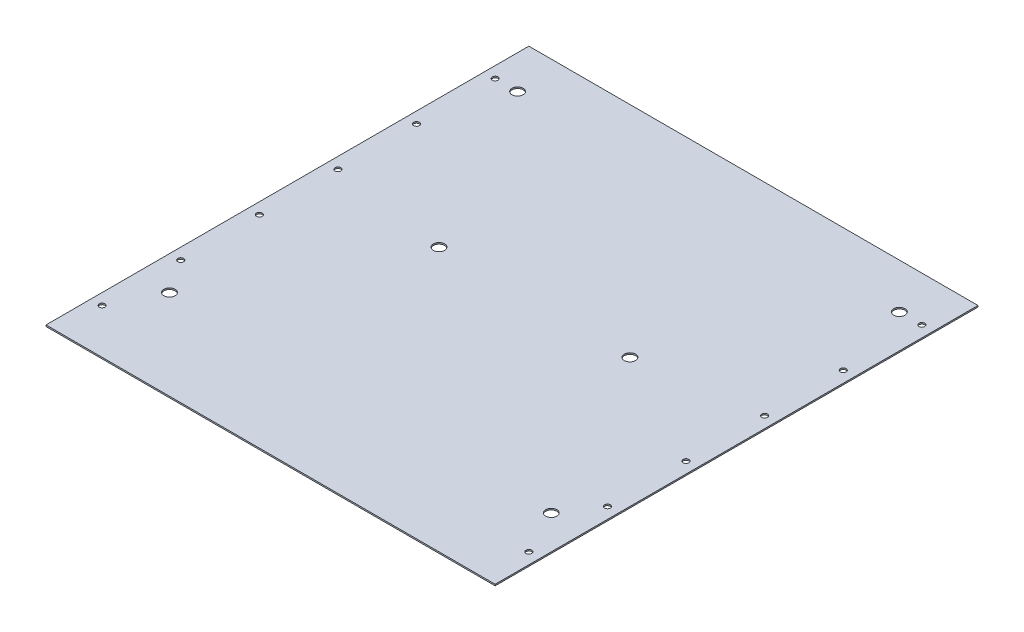
ISO-10303-21;
HEADER;
FILE_DESCRIPTION(('STEP AP214'),'2;1');
FILE_NAME('part.step','',(''),(''),'','','');
FILE_SCHEMA(('AUTOMOTIVE_DESIGN { 1 0 10303 214 1 1 1 1 }'));
ENDSEC;
DATA;
#1=APPLICATION_CONTEXT('core data for automotive mechanical design processes');
#2=APPLICATION_PROTOCOL_DEFINITION('international standard','automotive_design',2000,#1);
#3=PRODUCT_CONTEXT('',#1,'mechanical');
#4=PRODUCT('Part','Part','',(#3));
#5=PRODUCT_RELATED_PRODUCT_CATEGORY('part','',(#4));
#6=PRODUCT_DEFINITION_FORMATION('','',#4);
#7=PRODUCT_DEFINITION_CONTEXT('part definition',#1,'design');
#8=PRODUCT_DEFINITION('design','',#6,#7);
#9=PRODUCT_DEFINITION_SHAPE('','',#8);
#10=(LENGTH_UNIT() NAMED_UNIT(*) SI_UNIT(.MILLI.,.METRE.));
#11=(NAMED_UNIT(*) PLANE_ANGLE_UNIT() SI_UNIT($,.RADIAN.));
#12=(NAMED_UNIT(*) SI_UNIT($,.STERADIAN.) SOLID_ANGLE_UNIT());
#13=UNCERTAINTY_MEASURE_WITH_UNIT(LENGTH_MEASURE(1.E-05),#10,'distance_accuracy_value','');
#14=(GEOMETRIC_REPRESENTATION_CONTEXT(3) GLOBAL_UNCERTAINTY_ASSIGNED_CONTEXT((#13)) GLOBAL_UNIT_ASSIGNED_CONTEXT((#10,
#11,#12)) REPRESENTATION_CONTEXT('',''));
#15=CARTESIAN_POINT('',(0.,0.,0.));
#16=DIRECTION('',(0.,0.,1.));
#17=DIRECTION('',(1.,0.,0.));
#18=AXIS2_PLACEMENT_3D('',#15,#16,#17);
#19=CARTESIAN_POINT('',(-254.,1.6002,273.05));
#20=DIRECTION('',(1.,0.,0.));
#21=DIRECTION('',(0.,0.,1.));
#22=AXIS2_PLACEMENT_3D('',#19,#20,#21);
#23=PLANE('',#22);
#24=DIRECTION('',(0.,1.,0.));
#25=VECTOR('',#24,1.);
#26=CARTESIAN_POINT('',(-254.,1.6002,-273.05));
#27=LINE('',#26,#25);
#28=CARTESIAN_POINT('',(-254.,0.,-273.05));
#29=VERTEX_POINT('',#28);
#30=CARTESIAN_POINT('',(-254.,1.6002,-273.05));
#31=VERTEX_POINT('',#30);
#32=EDGE_CURVE('E11',#29,#31,#27,.T.);
#33=ORIENTED_EDGE('',*,*,#32,.F.);
#34=DIRECTION('',(0.,0.,-1.));
#35=VECTOR('',#34,1.);
#36=CARTESIAN_POINT('',(-254.,0.,0.));
#37=LINE('',#36,#35);
#38=CARTESIAN_POINT('',(-254.,0.,273.05));
#39=VERTEX_POINT('',#38);
#40=EDGE_CURVE('E97',#29,#39,#37,.F.);
#41=ORIENTED_EDGE('',*,*,#40,.T.);
#42=DIRECTION('',(0.,1.,0.));
#43=VECTOR('',#42,1.);
#44=CARTESIAN_POINT('',(-254.,1.6002,273.05));
#45=LINE('',#44,#43);
#46=CARTESIAN_POINT('',(-254.,1.6002,273.05));
#47=VERTEX_POINT('',#46);
#48=EDGE_CURVE('E50',#39,#47,#45,.T.);
#49=ORIENTED_EDGE('',*,*,#48,.T.);
#50=DIRECTION('',(0.,0.,1.));
#51=VECTOR('',#50,1.);
#52=CARTESIAN_POINT('',(-254.,1.6002,273.05));
#53=LINE('',#52,#51);
#54=EDGE_CURVE('E220',#31,#47,#53,.T.);
#55=ORIENTED_EDGE('',*,*,#54,.F.);
#56=EDGE_LOOP('',(#33,#41,#49,#55));
#57=FACE_BOUND('',#56,.T.);
#58=ADVANCED_FACE('F40',(#57),#23,.F.);
#59=CARTESIAN_POINT('',(-254.,1.6002,273.05));
#60=DIRECTION('',(0.,0.,-1.));
#61=DIRECTION('',(1.,0.,0.));
#62=AXIS2_PLACEMENT_3D('',#59,#60,#61);
#63=PLANE('',#62);
#64=ORIENTED_EDGE('',*,*,#48,.F.);
#65=DIRECTION('',(1.,0.,0.));
#66=VECTOR('',#65,1.);
#67=CARTESIAN_POINT('',(0.,0.,273.05));
#68=LINE('',#67,#66);
#69=CARTESIAN_POINT('',(254.,0.,273.05));
#70=VERTEX_POINT('',#69);
#71=EDGE_CURVE('E108',#39,#70,#68,.T.);
#72=ORIENTED_EDGE('',*,*,#71,.T.);
#73=DIRECTION('',(0.,1.,0.));
#74=VECTOR('',#73,1.);
#75=CARTESIAN_POINT('',(254.,1.6002,273.05));
#76=LINE('',#75,#74);
#77=CARTESIAN_POINT('',(254.,1.6002,273.05));
#78=VERTEX_POINT('',#77);
#79=EDGE_CURVE('E59',#70,#78,#76,.T.);
#80=ORIENTED_EDGE('',*,*,#79,.T.);
#81=DIRECTION('',(1.,0.,0.));
#82=VECTOR('',#81,1.);
#83=CARTESIAN_POINT('',(-254.,1.6002,273.05));
#84=LINE('',#83,#82);
#85=EDGE_CURVE('E90',#47,#78,#84,.T.);
#86=ORIENTED_EDGE('',*,*,#85,.F.);
#87=EDGE_LOOP('',(#64,#72,#80,#86));
#88=FACE_BOUND('',#87,.T.);
#89=ADVANCED_FACE('F225',(#88),#63,.F.);
#90=CARTESIAN_POINT('',(254.,1.6002,273.05));
#91=DIRECTION('',(-1.,0.,0.));
#92=DIRECTION('',(0.,0.,-1.));
#93=AXIS2_PLACEMENT_3D('',#90,#91,#92);
#94=PLANE('',#93);
#95=ORIENTED_EDGE('',*,*,#79,.F.);
#96=DIRECTION('',(0.,0.,-1.));
#97=VECTOR('',#96,1.);
#98=CARTESIAN_POINT('',(254.,0.,0.));
#99=LINE('',#98,#97);
#100=CARTESIAN_POINT('',(254.,0.,-273.05));
#101=VERTEX_POINT('',#100);
#102=EDGE_CURVE('E96',#70,#101,#99,.T.);
#103=ORIENTED_EDGE('',*,*,#102,.T.);
#104=DIRECTION('',(0.,1.,0.));
#105=VECTOR('',#104,1.);
#106=CARTESIAN_POINT('',(254.,1.6002,-273.05));
#107=LINE('',#106,#105);
#108=CARTESIAN_POINT('',(254.,1.6002,-273.05));
#109=VERTEX_POINT('',#108);
#110=EDGE_CURVE('E82',#101,#109,#107,.T.);
#111=ORIENTED_EDGE('',*,*,#110,.T.);
#112=DIRECTION('',(0.,0.,-1.));
#113=VECTOR('',#112,1.);
#114=CARTESIAN_POINT('',(254.,1.6002,273.05));
#115=LINE('',#114,#113);
#116=EDGE_CURVE('E110',#78,#109,#115,.T.);
#117=ORIENTED_EDGE('',*,*,#116,.F.);
#118=EDGE_LOOP('',(#95,#103,#111,#117));
#119=FACE_BOUND('',#118,.T.);
#120=ADVANCED_FACE('F99',(#119),#94,.F.);
#121=CARTESIAN_POINT('',(-254.,1.6002,-273.05));
#122=DIRECTION('',(0.,0.,1.));
#123=DIRECTION('',(-1.,0.,0.));
#124=AXIS2_PLACEMENT_3D('',#121,#122,#123);
#125=PLANE('',#124);
#126=DIRECTION('',(1.,0.,0.));
#127=VECTOR('',#126,1.);
#128=CARTESIAN_POINT('',(0.,0.,-273.05));
#129=LINE('',#128,#127);
#130=EDGE_CURVE('E84',#101,#29,#129,.F.);
#131=ORIENTED_EDGE('',*,*,#130,.T.);
#132=ORIENTED_EDGE('',*,*,#32,.T.);
#133=DIRECTION('',(-1.,0.,0.));
#134=VECTOR('',#133,1.);
#135=CARTESIAN_POINT('',(-254.,1.6002,-273.05));
#136=LINE('',#135,#134);
#137=EDGE_CURVE('E86',#109,#31,#136,.T.);
#138=ORIENTED_EDGE('',*,*,#137,.F.);
#139=ORIENTED_EDGE('',*,*,#110,.F.);
#140=EDGE_LOOP('',(#131,#132,#138,#139));
#141=FACE_BOUND('',#140,.T.);
#142=ADVANCED_FACE('F42',(#141),#125,.F.);
#143=CARTESIAN_POINT('',(0.,1.6002,0.));
#144=DIRECTION('',(0.,-1.,0.));
#145=DIRECTION('',(0.,0.,-1.));
#146=AXIS2_PLACEMENT_3D('',#143,#144,#145);
#147=PLANE('',#146);
#148=CARTESIAN_POINT('',(-107.95,1.6002,-25.3999999999998));
#149=DIRECTION('',(0.,1.,0.));
#150=DIRECTION('',(0.,0.,1.));
#151=AXIS2_PLACEMENT_3D('',#148,#149,#150);
#152=CIRCLE('',#151,6.35);
#153=CARTESIAN_POINT('',(-107.95,1.6002,-19.0499999999999));
#154=VERTEX_POINT('',#153);
#155=EDGE_CURVE('E124',#154,#154,#152,.T.);
#156=ORIENTED_EDGE('',*,*,#155,.F.);
#157=EDGE_LOOP('',(#156));
#158=FACE_BOUND('',#157,.T.);
#159=CARTESIAN_POINT('',(107.95,1.6002,-25.3999999999999));
#160=DIRECTION('',(0.,1.,0.));
#161=DIRECTION('',(0.,0.,1.));
#162=AXIS2_PLACEMENT_3D('',#159,#160,#161);
#163=CIRCLE('',#162,6.35);
#164=CARTESIAN_POINT('',(107.95,1.6002,-19.0499999999999));
#165=VERTEX_POINT('',#164);
#166=EDGE_CURVE('E130',#165,#165,#163,.T.);
#167=ORIENTED_EDGE('',*,*,#166,.F.);
#168=EDGE_LOOP('',(#167));
#169=FACE_BOUND('',#168,.T.);
#170=CARTESIAN_POINT('',(-241.299999999995,1.6002,222.25));
#171=DIRECTION('',(0.,1.,0.));
#172=DIRECTION('',(0.,0.,1.));
#173=AXIS2_PLACEMENT_3D('',#170,#171,#172);
#174=CIRCLE('',#173,3.26389999999998);
#175=CARTESIAN_POINT('',(-241.299999999995,1.6002,225.5139));
#176=VERTEX_POINT('',#175);
#177=EDGE_CURVE('E171',#176,#176,#174,.T.);
#178=ORIENTED_EDGE('',*,*,#177,.F.);
#179=EDGE_LOOP('',(#178));
#180=FACE_BOUND('',#179,.T.);
#181=CARTESIAN_POINT('',(241.3,1.6002,-222.25));
#182=DIRECTION('',(0.,1.,0.));
#183=DIRECTION('',(0.,0.,-1.));
#184=AXIS2_PLACEMENT_3D('',#181,#182,#183);
#185=CIRCLE('',#184,3.26389999999998);
#186=CARTESIAN_POINT('',(241.3,1.6002,-225.5139));
#187=VERTEX_POINT('',#186);
#188=EDGE_CURVE('E158',#187,#187,#185,.T.);
#189=ORIENTED_EDGE('',*,*,#188,.F.);
#190=EDGE_LOOP('',(#189));
#191=FACE_BOUND('',#190,.T.);
#192=CARTESIAN_POINT('',(241.299999999999,1.6002,-133.35));
#193=DIRECTION('',(0.,1.,0.));
#194=DIRECTION('',(0.,0.,-1.));
#195=AXIS2_PLACEMENT_3D('',#192,#193,#194);
#196=CIRCLE('',#195,3.26389999999998);
#197=CARTESIAN_POINT('',(241.299999999999,1.6002,-136.6139));
#198=VERTEX_POINT('',#197);
#199=EDGE_CURVE('E159',#198,#198,#196,.T.);
#200=ORIENTED_EDGE('',*,*,#199,.F.);
#201=EDGE_LOOP('',(#200));
#202=FACE_BOUND('',#201,.T.);
#203=CARTESIAN_POINT('',(241.299999999998,1.6002,-44.4499999999999));
#204=DIRECTION('',(0.,1.,0.));
#205=DIRECTION('',(0.,0.,-1.));
#206=AXIS2_PLACEMENT_3D('',#203,#204,#205);
#207=CIRCLE('',#206,3.26389999999998);
#208=CARTESIAN_POINT('',(241.299999999998,1.6002,-47.7138999999999));
#209=VERTEX_POINT('',#208);
#210=EDGE_CURVE('E140',#209,#209,#207,.T.);
#211=ORIENTED_EDGE('',*,*,#210,.F.);
#212=EDGE_LOOP('',(#211));
#213=FACE_BOUND('',#212,.T.);
#214=CARTESIAN_POINT('',(-241.299999999996,1.6002,133.35));
#215=DIRECTION('',(0.,1.,0.));
#216=DIRECTION('',(0.,0.,1.));
#217=AXIS2_PLACEMENT_3D('',#214,#215,#216);
#218=CIRCLE('',#217,3.26389999999998);
#219=CARTESIAN_POINT('',(-241.299999999996,1.6002,136.6139));
#220=VERTEX_POINT('',#219);
#221=EDGE_CURVE('E170',#220,#220,#218,.T.);
#222=ORIENTED_EDGE('',*,*,#221,.F.);
#223=EDGE_LOOP('',(#222));
#224=FACE_BOUND('',#223,.T.);
#225=CARTESIAN_POINT('',(-241.299999999997,1.6002,44.4500000000001));
#226=DIRECTION('',(0.,1.,0.));
#227=DIRECTION('',(0.,0.,1.));
#228=AXIS2_PLACEMENT_3D('',#225,#226,#227);
#229=CIRCLE('',#228,3.26389999999998);
#230=CARTESIAN_POINT('',(-241.299999999997,1.6002,47.7139000000001));
#231=VERTEX_POINT('',#230);
#232=EDGE_CURVE('E195',#231,#231,#229,.T.);
#233=ORIENTED_EDGE('',*,*,#232,.F.);
#234=EDGE_LOOP('',(#233));
#235=FACE_BOUND('',#234,.T.);
#236=CARTESIAN_POINT('',(-241.299999999998,1.6002,-44.4499999999999));
#237=DIRECTION('',(0.,1.,0.));
#238=DIRECTION('',(0.,0.,1.));
#239=AXIS2_PLACEMENT_3D('',#236,#237,#238);
#240=CIRCLE('',#239,3.26389999999998);
#241=CARTESIAN_POINT('',(-241.299999999998,1.6002,-41.1860999999999));
#242=VERTEX_POINT('',#241);
#243=EDGE_CURVE('E189',#242,#242,#240,.T.);
#244=ORIENTED_EDGE('',*,*,#243,.F.);
#245=EDGE_LOOP('',(#244));
#246=FACE_BOUND('',#245,.T.);
#247=CARTESIAN_POINT('',(-241.299999999999,1.6002,-133.35));
#248=DIRECTION('',(0.,1.,0.));
#249=DIRECTION('',(0.,0.,1.));
#250=AXIS2_PLACEMENT_3D('',#247,#248,#249);
#251=CIRCLE('',#250,3.26389999999998);
#252=CARTESIAN_POINT('',(-241.299999999999,1.6002,-130.0861));
#253=VERTEX_POINT('',#252);
#254=EDGE_CURVE('E183',#253,#253,#251,.T.);
#255=ORIENTED_EDGE('',*,*,#254,.F.);
#256=EDGE_LOOP('',(#255));
#257=FACE_BOUND('',#256,.T.);
#258=CARTESIAN_POINT('',(241.299999999997,1.6002,44.4500000000001));
#259=DIRECTION('',(0.,1.,0.));
#260=DIRECTION('',(0.,0.,-1.));
#261=AXIS2_PLACEMENT_3D('',#258,#259,#260);
#262=CIRCLE('',#261,3.26389999999998);
#263=CARTESIAN_POINT('',(241.299999999997,1.6002,41.1861000000001));
#264=VERTEX_POINT('',#263);
#265=EDGE_CURVE('E141',#264,#264,#262,.T.);
#266=ORIENTED_EDGE('',*,*,#265,.F.);
#267=EDGE_LOOP('',(#266));
#268=FACE_BOUND('',#267,.T.);
#269=CARTESIAN_POINT('',(241.299999999996,1.6002,133.35));
#270=DIRECTION('',(0.,1.,0.));
#271=DIRECTION('',(0.,0.,-1.));
#272=AXIS2_PLACEMENT_3D('',#269,#270,#271);
#273=CIRCLE('',#272,3.26389999999998);
#274=CARTESIAN_POINT('',(241.299999999996,1.6002,130.0861));
#275=VERTEX_POINT('',#274);
#276=EDGE_CURVE('E147',#275,#275,#273,.T.);
#277=ORIENTED_EDGE('',*,*,#276,.F.);
#278=EDGE_LOOP('',(#277));
#279=FACE_BOUND('',#278,.T.);
#280=CARTESIAN_POINT('',(241.299999999995,1.6002,222.25));
#281=DIRECTION('',(0.,1.,0.));
#282=DIRECTION('',(0.,0.,-1.));
#283=AXIS2_PLACEMENT_3D('',#280,#281,#282);
#284=CIRCLE('',#283,3.26389999999998);
#285=CARTESIAN_POINT('',(241.299999999995,1.6002,218.9861));
#286=VERTEX_POINT('',#285);
#287=EDGE_CURVE('E128',#286,#286,#284,.T.);
#288=ORIENTED_EDGE('',*,*,#287,.F.);
#289=EDGE_LOOP('',(#288));
#290=FACE_BOUND('',#289,.T.);
#291=CARTESIAN_POINT('',(-241.3,1.6002,-222.25));
#292=DIRECTION('',(0.,1.,0.));
#293=DIRECTION('',(0.,0.,1.));
#294=AXIS2_PLACEMENT_3D('',#291,#292,#293);
#295=CIRCLE('',#294,3.26389999999998);
#296=CARTESIAN_POINT('',(-241.3,1.6002,-218.9861));
#297=VERTEX_POINT('',#296);
#298=EDGE_CURVE('E182',#297,#297,#295,.T.);
#299=ORIENTED_EDGE('',*,*,#298,.F.);
#300=EDGE_LOOP('',(#299));
#301=FACE_BOUND('',#300,.T.);
#302=CARTESIAN_POINT('',(215.9,1.6002,171.45));
#303=DIRECTION('',(0.,1.,0.));
#304=DIRECTION('',(0.,0.,1.));
#305=AXIS2_PLACEMENT_3D('',#302,#303,#304);
#306=CIRCLE('',#305,6.34999999999999);
#307=CARTESIAN_POINT('',(215.9,1.6002,177.8));
#308=VERTEX_POINT('',#307);
#309=EDGE_CURVE('E212',#308,#308,#306,.T.);
#310=ORIENTED_EDGE('',*,*,#309,.F.);
#311=EDGE_LOOP('',(#310));
#312=FACE_BOUND('',#311,.T.);
#313=CARTESIAN_POINT('',(-215.9,1.6002,-222.25));
#314=DIRECTION('',(0.,1.,0.));
#315=DIRECTION('',(0.,0.,1.));
#316=AXIS2_PLACEMENT_3D('',#313,#314,#315);
#317=CIRCLE('',#316,6.34999999999999);
#318=CARTESIAN_POINT('',(-215.9,1.6002,-215.9));
#319=VERTEX_POINT('',#318);
#320=EDGE_CURVE('E211',#319,#319,#317,.T.);
#321=ORIENTED_EDGE('',*,*,#320,.F.);
#322=EDGE_LOOP('',(#321));
#323=FACE_BOUND('',#322,.T.);
#324=CARTESIAN_POINT('',(-215.9,1.6002,171.45));
#325=DIRECTION('',(0.,1.,0.));
#326=DIRECTION('',(0.,0.,1.));
#327=AXIS2_PLACEMENT_3D('',#324,#325,#326);
#328=CIRCLE('',#327,6.34999999999999);
#329=CARTESIAN_POINT('',(-215.9,1.6002,177.8));
#330=VERTEX_POINT('',#329);
#331=EDGE_CURVE('E206',#330,#330,#328,.T.);
#332=ORIENTED_EDGE('',*,*,#331,.F.);
#333=EDGE_LOOP('',(#332));
#334=FACE_BOUND('',#333,.T.);
#335=CARTESIAN_POINT('',(215.9,1.6002,-222.25));
#336=DIRECTION('',(0.,1.,0.));
#337=DIRECTION('',(0.,0.,1.));
#338=AXIS2_PLACEMENT_3D('',#335,#336,#337);
#339=CIRCLE('',#338,6.34999999999999);
#340=CARTESIAN_POINT('',(215.9,1.6002,-215.9));
#341=VERTEX_POINT('',#340);
#342=EDGE_CURVE('E118',#341,#341,#339,.T.);
#343=ORIENTED_EDGE('',*,*,#342,.F.);
#344=EDGE_LOOP('',(#343));
#345=FACE_BOUND('',#344,.T.);
#346=ORIENTED_EDGE('',*,*,#116,.T.);
#347=ORIENTED_EDGE('',*,*,#137,.T.);
#348=ORIENTED_EDGE('',*,*,#54,.T.);
#349=ORIENTED_EDGE('',*,*,#85,.T.);
#350=EDGE_LOOP('',(#346,#347,#348,#349));
#351=FACE_BOUND('',#350,.T.);
#352=ADVANCED_FACE('F224',(#158,#169,#180,#191,#202,#213,#224,#235,#246,#257,#268,#279,#290,
#301,#312,#323,#334,#345,#351),#147,.F.);
#353=CARTESIAN_POINT('',(0.,0.,0.));
#354=DIRECTION('',(0.,-1.,0.));
#355=DIRECTION('',(0.,0.,-1.));
#356=AXIS2_PLACEMENT_3D('',#353,#354,#355);
#357=PLANE('',#356);
#358=CARTESIAN_POINT('',(-107.95,0.,-25.3999999999998));
#359=DIRECTION('',(0.,-1.,0.));
#360=DIRECTION('',(0.,0.,-1.));
#361=AXIS2_PLACEMENT_3D('',#358,#359,#360);
#362=CIRCLE('',#361,6.35);
#363=CARTESIAN_POINT('',(-107.95,0.,-31.7499999999998));
#364=VERTEX_POINT('',#363);
#365=EDGE_CURVE('E44',#364,#364,#362,.T.);
#366=ORIENTED_EDGE('',*,*,#365,.F.);
#367=EDGE_LOOP('',(#366));
#368=FACE_BOUND('',#367,.T.);
#369=CARTESIAN_POINT('',(107.95,0.,-25.3999999999999));
#370=DIRECTION('',(0.,-1.,0.));
#371=DIRECTION('',(0.,0.,-1.));
#372=AXIS2_PLACEMENT_3D('',#369,#370,#371);
#373=CIRCLE('',#372,6.35);
#374=CARTESIAN_POINT('',(107.95,0.,-31.7499999999999));
#375=VERTEX_POINT('',#374);
#376=EDGE_CURVE('E122',#375,#375,#373,.T.);
#377=ORIENTED_EDGE('',*,*,#376,.F.);
#378=EDGE_LOOP('',(#377));
#379=FACE_BOUND('',#378,.T.);
#380=CARTESIAN_POINT('',(-241.299999999995,0.,222.25));
#381=DIRECTION('',(0.,1.,0.));
#382=DIRECTION('',(0.,0.,1.));
#383=AXIS2_PLACEMENT_3D('',#380,#381,#382);
#384=CIRCLE('',#383,3.26389999999998);
#385=CARTESIAN_POINT('',(-241.299999999995,0.,225.5139));
#386=VERTEX_POINT('',#385);
#387=EDGE_CURVE('E167',#386,#386,#384,.T.);
#388=ORIENTED_EDGE('',*,*,#387,.T.);
#389=EDGE_LOOP('',(#388));
#390=FACE_BOUND('',#389,.T.);
#391=CARTESIAN_POINT('',(241.3,0.,-222.25));
#392=DIRECTION('',(0.,1.,0.));
#393=DIRECTION('',(0.,0.,-1.));
#394=AXIS2_PLACEMENT_3D('',#391,#392,#393);
#395=CIRCLE('',#394,3.26389999999998);
#396=CARTESIAN_POINT('',(241.3,0.,-225.5139));
#397=VERTEX_POINT('',#396);
#398=EDGE_CURVE('E174',#397,#397,#395,.T.);
#399=ORIENTED_EDGE('',*,*,#398,.T.);
#400=EDGE_LOOP('',(#399));
#401=FACE_BOUND('',#400,.T.);
#402=CARTESIAN_POINT('',(241.299999999999,0.,-133.35));
#403=DIRECTION('',(0.,1.,0.));
#404=DIRECTION('',(0.,0.,-1.));
#405=AXIS2_PLACEMENT_3D('',#402,#403,#404);
#406=CIRCLE('',#405,3.26389999999998);
#407=CARTESIAN_POINT('',(241.299999999999,0.,-136.6139));
#408=VERTEX_POINT('',#407);
#409=EDGE_CURVE('E155',#408,#408,#406,.T.);
#410=ORIENTED_EDGE('',*,*,#409,.T.);
#411=EDGE_LOOP('',(#410));
#412=FACE_BOUND('',#411,.T.);
#413=CARTESIAN_POINT('',(241.299999999998,0.,-44.4499999999999));
#414=DIRECTION('',(0.,1.,0.));
#415=DIRECTION('',(0.,0.,-1.));
#416=AXIS2_PLACEMENT_3D('',#413,#414,#415);
#417=CIRCLE('',#416,3.26389999999998);
#418=CARTESIAN_POINT('',(241.299999999998,0.,-47.7138999999999));
#419=VERTEX_POINT('',#418);
#420=EDGE_CURVE('E162',#419,#419,#417,.T.);
#421=ORIENTED_EDGE('',*,*,#420,.T.);
#422=EDGE_LOOP('',(#421));
#423=FACE_BOUND('',#422,.T.);
#424=CARTESIAN_POINT('',(-241.299999999996,0.,133.35));
#425=DIRECTION('',(0.,1.,0.));
#426=DIRECTION('',(0.,0.,1.));
#427=AXIS2_PLACEMENT_3D('',#424,#425,#426);
#428=CIRCLE('',#427,3.26389999999998);
#429=CARTESIAN_POINT('',(-241.299999999996,0.,136.6139));
#430=VERTEX_POINT('',#429);
#431=EDGE_CURVE('E198',#430,#430,#428,.T.);
#432=ORIENTED_EDGE('',*,*,#431,.T.);
#433=EDGE_LOOP('',(#432));
#434=FACE_BOUND('',#433,.T.);
#435=CARTESIAN_POINT('',(-241.299999999997,0.,44.4500000000001));
#436=DIRECTION('',(0.,1.,0.));
#437=DIRECTION('',(0.,0.,1.));
#438=AXIS2_PLACEMENT_3D('',#435,#436,#437);
#439=CIRCLE('',#438,3.26389999999998);
#440=CARTESIAN_POINT('',(-241.299999999997,0.,47.7139000000001));
#441=VERTEX_POINT('',#440);
#442=EDGE_CURVE('E192',#441,#441,#439,.T.);
#443=ORIENTED_EDGE('',*,*,#442,.T.);
#444=EDGE_LOOP('',(#443));
#445=FACE_BOUND('',#444,.T.);
#446=CARTESIAN_POINT('',(-241.299999999998,0.,-44.4499999999999));
#447=DIRECTION('',(0.,1.,0.));
#448=DIRECTION('',(0.,0.,1.));
#449=AXIS2_PLACEMENT_3D('',#446,#447,#448);
#450=CIRCLE('',#449,3.26389999999998);
#451=CARTESIAN_POINT('',(-241.299999999998,0.,-41.1860999999999));
#452=VERTEX_POINT('',#451);
#453=EDGE_CURVE('E186',#452,#452,#450,.T.);
#454=ORIENTED_EDGE('',*,*,#453,.T.);
#455=EDGE_LOOP('',(#454));
#456=FACE_BOUND('',#455,.T.);
#457=CARTESIAN_POINT('',(-241.299999999999,0.,-133.35));
#458=DIRECTION('',(0.,1.,0.));
#459=DIRECTION('',(0.,0.,1.));
#460=AXIS2_PLACEMENT_3D('',#457,#458,#459);
#461=CIRCLE('',#460,3.26389999999998);
#462=CARTESIAN_POINT('',(-241.299999999999,0.,-130.0861));
#463=VERTEX_POINT('',#462);
#464=EDGE_CURVE('E179',#463,#463,#461,.T.);
#465=ORIENTED_EDGE('',*,*,#464,.T.);
#466=EDGE_LOOP('',(#465));
#467=FACE_BOUND('',#466,.T.);
#468=CARTESIAN_POINT('',(241.299999999997,0.,44.4500000000001));
#469=DIRECTION('',(0.,1.,0.));
#470=DIRECTION('',(0.,0.,-1.));
#471=AXIS2_PLACEMENT_3D('',#468,#469,#470);
#472=CIRCLE('',#471,3.26389999999998);
#473=CARTESIAN_POINT('',(241.299999999997,0.,41.1861000000001));
#474=VERTEX_POINT('',#473);
#475=EDGE_CURVE('E137',#474,#474,#472,.T.);
#476=ORIENTED_EDGE('',*,*,#475,.T.);
#477=EDGE_LOOP('',(#476));
#478=FACE_BOUND('',#477,.T.);
#479=CARTESIAN_POINT('',(241.299999999996,0.,133.35));
#480=DIRECTION('',(0.,1.,0.));
#481=DIRECTION('',(0.,0.,-1.));
#482=AXIS2_PLACEMENT_3D('',#479,#480,#481);
#483=CIRCLE('',#482,3.26389999999998);
#484=CARTESIAN_POINT('',(241.299999999996,0.,130.0861));
#485=VERTEX_POINT('',#484);
#486=EDGE_CURVE('E144',#485,#485,#483,.T.);
#487=ORIENTED_EDGE('',*,*,#486,.T.);
#488=EDGE_LOOP('',(#487));
#489=FACE_BOUND('',#488,.T.);
#490=CARTESIAN_POINT('',(241.299999999995,0.,222.25));
#491=DIRECTION('',(0.,1.,0.));
#492=DIRECTION('',(0.,0.,-1.));
#493=AXIS2_PLACEMENT_3D('',#490,#491,#492);
#494=CIRCLE('',#493,3.26389999999998);
#495=CARTESIAN_POINT('',(241.299999999995,0.,218.9861));
#496=VERTEX_POINT('',#495);
#497=EDGE_CURVE('E150',#496,#496,#494,.T.);
#498=ORIENTED_EDGE('',*,*,#497,.T.);
#499=EDGE_LOOP('',(#498));
#500=FACE_BOUND('',#499,.T.);
#501=CARTESIAN_POINT('',(-241.3,0.,-222.25));
#502=DIRECTION('',(0.,1.,0.));
#503=DIRECTION('',(0.,0.,1.));
#504=AXIS2_PLACEMENT_3D('',#501,#502,#503);
#505=CIRCLE('',#504,3.26389999999998);
#506=CARTESIAN_POINT('',(-241.3,0.,-218.9861));
#507=VERTEX_POINT('',#506);
#508=EDGE_CURVE('E203',#507,#507,#505,.T.);
#509=ORIENTED_EDGE('',*,*,#508,.T.);
#510=EDGE_LOOP('',(#509));
#511=FACE_BOUND('',#510,.T.);
#512=CARTESIAN_POINT('',(215.9,0.,171.45));
#513=DIRECTION('',(0.,-1.,0.));
#514=DIRECTION('',(0.,0.,-1.));
#515=AXIS2_PLACEMENT_3D('',#512,#513,#514);
#516=CIRCLE('',#515,6.34999999999999);
#517=CARTESIAN_POINT('',(215.9,0.,165.1));
#518=VERTEX_POINT('',#517);
#519=EDGE_CURVE('E100',#518,#518,#516,.T.);
#520=ORIENTED_EDGE('',*,*,#519,.F.);
#521=EDGE_LOOP('',(#520));
#522=FACE_BOUND('',#521,.T.);
#523=CARTESIAN_POINT('',(-215.9,0.,-222.25));
#524=DIRECTION('',(0.,-1.,0.));
#525=DIRECTION('',(0.,0.,-1.));
#526=AXIS2_PLACEMENT_3D('',#523,#524,#525);
#527=CIRCLE('',#526,6.34999999999999);
#528=CARTESIAN_POINT('',(-215.9,0.,-228.6));
#529=VERTEX_POINT('',#528);
#530=EDGE_CURVE('E103',#529,#529,#527,.T.);
#531=ORIENTED_EDGE('',*,*,#530,.F.);
#532=EDGE_LOOP('',(#531));
#533=FACE_BOUND('',#532,.T.);
#534=CARTESIAN_POINT('',(-215.9,0.,171.45));
#535=DIRECTION('',(0.,-1.,0.));
#536=DIRECTION('',(0.,0.,-1.));
#537=AXIS2_PLACEMENT_3D('',#534,#535,#536);
#538=CIRCLE('',#537,6.34999999999999);
#539=CARTESIAN_POINT('',(-215.9,0.,165.1));
#540=VERTEX_POINT('',#539);
#541=EDGE_CURVE('E117',#540,#540,#538,.T.);
#542=ORIENTED_EDGE('',*,*,#541,.F.);
#543=EDGE_LOOP('',(#542));
#544=FACE_BOUND('',#543,.T.);
#545=CARTESIAN_POINT('',(215.9,0.,-222.25));
#546=DIRECTION('',(0.,-1.,0.));
#547=DIRECTION('',(0.,0.,-1.));
#548=AXIS2_PLACEMENT_3D('',#545,#546,#547);
#549=CIRCLE('',#548,6.34999999999999);
#550=CARTESIAN_POINT('',(215.9,0.,-228.6));
#551=VERTEX_POINT('',#550);
#552=EDGE_CURVE('E114',#551,#551,#549,.T.);
#553=ORIENTED_EDGE('',*,*,#552,.F.);
#554=EDGE_LOOP('',(#553));
#555=FACE_BOUND('',#554,.T.);
#556=ORIENTED_EDGE('',*,*,#102,.F.);
#557=ORIENTED_EDGE('',*,*,#71,.F.);
#558=ORIENTED_EDGE('',*,*,#40,.F.);
#559=ORIENTED_EDGE('',*,*,#130,.F.);
#560=EDGE_LOOP('',(#556,#557,#558,#559));
#561=FACE_BOUND('',#560,.T.);
#562=ADVANCED_FACE('F94',(#368,#379,#390,#401,#412,#423,#434,#445,#456,#467,#478,#489,#500,#511,
#522,#533,#544,#555,#561),#357,.T.);
#563=CARTESIAN_POINT('',(215.9,-0.9398,-222.25));
#564=DIRECTION('',(0.,1.,0.));
#565=DIRECTION('',(0.,0.,1.));
#566=AXIS2_PLACEMENT_3D('',#563,#564,#565);
#567=CYLINDRICAL_SURFACE('',#566,6.34999999999999);
#568=ORIENTED_EDGE('',*,*,#552,.T.);
#569=EDGE_LOOP('',(#568));
#570=FACE_BOUND('',#569,.T.);
#571=ORIENTED_EDGE('',*,*,#342,.T.);
#572=EDGE_LOOP('',(#571));
#573=FACE_BOUND('',#572,.T.);
#574=ADVANCED_FACE('F236',(#570,#573),#567,.F.);
#575=CARTESIAN_POINT('',(-215.9,-0.9398,171.45));
#576=DIRECTION('',(0.,1.,0.));
#577=DIRECTION('',(0.,0.,1.));
#578=AXIS2_PLACEMENT_3D('',#575,#576,#577);
#579=CYLINDRICAL_SURFACE('',#578,6.34999999999999);
#580=ORIENTED_EDGE('',*,*,#541,.T.);
#581=EDGE_LOOP('',(#580));
#582=FACE_BOUND('',#581,.T.);
#583=ORIENTED_EDGE('',*,*,#331,.T.);
#584=EDGE_LOOP('',(#583));
#585=FACE_BOUND('',#584,.T.);
#586=ADVANCED_FACE('F243',(#582,#585),#579,.F.);
#587=CARTESIAN_POINT('',(-215.9,-0.9398,-222.25));
#588=DIRECTION('',(0.,1.,0.));
#589=DIRECTION('',(0.,0.,1.));
#590=AXIS2_PLACEMENT_3D('',#587,#588,#589);
#591=CYLINDRICAL_SURFACE('',#590,6.34999999999999);
#592=ORIENTED_EDGE('',*,*,#530,.T.);
#593=EDGE_LOOP('',(#592));
#594=FACE_BOUND('',#593,.T.);
#595=ORIENTED_EDGE('',*,*,#320,.T.);
#596=EDGE_LOOP('',(#595));
#597=FACE_BOUND('',#596,.T.);
#598=ADVANCED_FACE('F245',(#594,#597),#591,.F.);
#599=CARTESIAN_POINT('',(215.9,-0.9398,171.45));
#600=DIRECTION('',(0.,1.,0.));
#601=DIRECTION('',(0.,0.,1.));
#602=AXIS2_PLACEMENT_3D('',#599,#600,#601);
#603=CYLINDRICAL_SURFACE('',#602,6.34999999999999);
#604=ORIENTED_EDGE('',*,*,#519,.T.);
#605=EDGE_LOOP('',(#604));
#606=FACE_BOUND('',#605,.T.);
#607=ORIENTED_EDGE('',*,*,#309,.T.);
#608=EDGE_LOOP('',(#607));
#609=FACE_BOUND('',#608,.T.);
#610=ADVANCED_FACE('F248',(#606,#609),#603,.F.);
#611=CARTESIAN_POINT('',(-241.3,0.,-222.25));
#612=DIRECTION('',(0.,1.,0.));
#613=DIRECTION('',(0.,0.,1.));
#614=AXIS2_PLACEMENT_3D('',#611,#612,#613);
#615=CYLINDRICAL_SURFACE('',#614,3.26389999999998);
#616=ORIENTED_EDGE('',*,*,#508,.F.);
#617=EDGE_LOOP('',(#616));
#618=FACE_BOUND('',#617,.T.);
#619=ORIENTED_EDGE('',*,*,#298,.T.);
#620=EDGE_LOOP('',(#619));
#621=FACE_BOUND('',#620,.T.);
#622=ADVANCED_FACE('F252',(#618,#621),#615,.F.);
#623=CARTESIAN_POINT('',(241.299999999995,0.,222.25));
#624=DIRECTION('',(0.,1.,0.));
#625=DIRECTION('',(0.,0.,1.));
#626=AXIS2_PLACEMENT_3D('',#623,#624,#625);
#627=CYLINDRICAL_SURFACE('',#626,3.26389999999998);
#628=ORIENTED_EDGE('',*,*,#497,.F.);
#629=EDGE_LOOP('',(#628));
#630=FACE_BOUND('',#629,.T.);
#631=ORIENTED_EDGE('',*,*,#287,.T.);
#632=EDGE_LOOP('',(#631));
#633=FACE_BOUND('',#632,.T.);
#634=ADVANCED_FACE('F259',(#630,#633),#627,.F.);
#635=CARTESIAN_POINT('',(241.299999999996,0.,133.35));
#636=DIRECTION('',(0.,1.,0.));
#637=DIRECTION('',(0.,0.,1.));
#638=AXIS2_PLACEMENT_3D('',#635,#636,#637);
#639=CYLINDRICAL_SURFACE('',#638,3.26389999999998);
#640=ORIENTED_EDGE('',*,*,#486,.F.);
#641=EDGE_LOOP('',(#640));
#642=FACE_BOUND('',#641,.T.);
#643=ORIENTED_EDGE('',*,*,#276,.T.);
#644=EDGE_LOOP('',(#643));
#645=FACE_BOUND('',#644,.T.);
#646=ADVANCED_FACE('F297',(#642,#645),#639,.F.);
#647=CARTESIAN_POINT('',(241.299999999997,0.,44.4500000000001));
#648=DIRECTION('',(0.,1.,0.));
#649=DIRECTION('',(0.,0.,1.));
#650=AXIS2_PLACEMENT_3D('',#647,#648,#649);
#651=CYLINDRICAL_SURFACE('',#650,3.26389999999998);
#652=ORIENTED_EDGE('',*,*,#475,.F.);
#653=EDGE_LOOP('',(#652));
#654=FACE_BOUND('',#653,.T.);
#655=ORIENTED_EDGE('',*,*,#265,.T.);
#656=EDGE_LOOP('',(#655));
#657=FACE_BOUND('',#656,.T.);
#658=ADVANCED_FACE('F277',(#654,#657),#651,.F.);
#659=CARTESIAN_POINT('',(-241.299999999999,0.,-133.35));
#660=DIRECTION('',(0.,1.,0.));
#661=DIRECTION('',(0.,0.,1.));
#662=AXIS2_PLACEMENT_3D('',#659,#660,#661);
#663=CYLINDRICAL_SURFACE('',#662,3.26389999999998);
#664=ORIENTED_EDGE('',*,*,#464,.F.);
#665=EDGE_LOOP('',(#664));
#666=FACE_BOUND('',#665,.T.);
#667=ORIENTED_EDGE('',*,*,#254,.T.);
#668=EDGE_LOOP('',(#667));
#669=FACE_BOUND('',#668,.T.);
#670=ADVANCED_FACE('F273',(#666,#669),#663,.F.);
#671=CARTESIAN_POINT('',(-241.299999999998,0.,-44.4499999999999));
#672=DIRECTION('',(0.,1.,0.));
#673=DIRECTION('',(0.,0.,1.));
#674=AXIS2_PLACEMENT_3D('',#671,#672,#673);
#675=CYLINDRICAL_SURFACE('',#674,3.26389999999998);
#676=ORIENTED_EDGE('',*,*,#453,.F.);
#677=EDGE_LOOP('',(#676));
#678=FACE_BOUND('',#677,.T.);
#679=ORIENTED_EDGE('',*,*,#243,.T.);
#680=EDGE_LOOP('',(#679));
#681=FACE_BOUND('',#680,.T.);
#682=ADVANCED_FACE('F269',(#678,#681),#675,.F.);
#683=CARTESIAN_POINT('',(-241.299999999997,0.,44.4500000000001));
#684=DIRECTION('',(0.,1.,0.));
#685=DIRECTION('',(0.,0.,1.));
#686=AXIS2_PLACEMENT_3D('',#683,#684,#685);
#687=CYLINDRICAL_SURFACE('',#686,3.26389999999998);
#688=ORIENTED_EDGE('',*,*,#442,.F.);
#689=EDGE_LOOP('',(#688));
#690=FACE_BOUND('',#689,.T.);
#691=ORIENTED_EDGE('',*,*,#232,.T.);
#692=EDGE_LOOP('',(#691));
#693=FACE_BOUND('',#692,.T.);
#694=ADVANCED_FACE('F265',(#690,#693),#687,.F.);
#695=CARTESIAN_POINT('',(-241.299999999996,0.,133.35));
#696=DIRECTION('',(0.,1.,0.));
#697=DIRECTION('',(0.,0.,1.));
#698=AXIS2_PLACEMENT_3D('',#695,#696,#697);
#699=CYLINDRICAL_SURFACE('',#698,3.26389999999998);
#700=ORIENTED_EDGE('',*,*,#431,.F.);
#701=EDGE_LOOP('',(#700));
#702=FACE_BOUND('',#701,.T.);
#703=ORIENTED_EDGE('',*,*,#221,.T.);
#704=EDGE_LOOP('',(#703));
#705=FACE_BOUND('',#704,.T.);
#706=ADVANCED_FACE('F261',(#702,#705),#699,.F.);
#707=CARTESIAN_POINT('',(241.299999999998,0.,-44.4499999999999));
#708=DIRECTION('',(0.,1.,0.));
#709=DIRECTION('',(0.,0.,1.));
#710=AXIS2_PLACEMENT_3D('',#707,#708,#709);
#711=CYLINDRICAL_SURFACE('',#710,3.26389999999998);
#712=ORIENTED_EDGE('',*,*,#420,.F.);
#713=EDGE_LOOP('',(#712));
#714=FACE_BOUND('',#713,.T.);
#715=ORIENTED_EDGE('',*,*,#210,.T.);
#716=EDGE_LOOP('',(#715));
#717=FACE_BOUND('',#716,.T.);
#718=ADVANCED_FACE('F264',(#714,#717),#711,.F.);
#719=CARTESIAN_POINT('',(241.299999999999,0.,-133.35));
#720=DIRECTION('',(0.,1.,0.));
#721=DIRECTION('',(0.,0.,1.));
#722=AXIS2_PLACEMENT_3D('',#719,#720,#721);
#723=CYLINDRICAL_SURFACE('',#722,3.26389999999998);
#724=ORIENTED_EDGE('',*,*,#409,.F.);
#725=EDGE_LOOP('',(#724));
#726=FACE_BOUND('',#725,.T.);
#727=ORIENTED_EDGE('',*,*,#199,.T.);
#728=EDGE_LOOP('',(#727));
#729=FACE_BOUND('',#728,.T.);
#730=ADVANCED_FACE('F283',(#726,#729),#723,.F.);
#731=CARTESIAN_POINT('',(241.3,0.,-222.25));
#732=DIRECTION('',(0.,1.,0.));
#733=DIRECTION('',(0.,0.,1.));
#734=AXIS2_PLACEMENT_3D('',#731,#732,#733);
#735=CYLINDRICAL_SURFACE('',#734,3.26389999999998);
#736=ORIENTED_EDGE('',*,*,#398,.F.);
#737=EDGE_LOOP('',(#736));
#738=FACE_BOUND('',#737,.T.);
#739=ORIENTED_EDGE('',*,*,#188,.T.);
#740=EDGE_LOOP('',(#739));
#741=FACE_BOUND('',#740,.T.);
#742=ADVANCED_FACE('F279',(#738,#741),#735,.F.);
#743=CARTESIAN_POINT('',(-241.299999999995,0.,222.25));
#744=DIRECTION('',(0.,1.,0.));
#745=DIRECTION('',(0.,0.,1.));
#746=AXIS2_PLACEMENT_3D('',#743,#744,#745);
#747=CYLINDRICAL_SURFACE('',#746,3.26389999999998);
#748=ORIENTED_EDGE('',*,*,#387,.F.);
#749=EDGE_LOOP('',(#748));
#750=FACE_BOUND('',#749,.T.);
#751=ORIENTED_EDGE('',*,*,#177,.T.);
#752=EDGE_LOOP('',(#751));
#753=FACE_BOUND('',#752,.T.);
#754=ADVANCED_FACE('F282',(#750,#753),#747,.F.);
#755=CARTESIAN_POINT('',(107.95,-0.9398,-25.3999999999999));
#756=DIRECTION('',(0.,1.,0.));
#757=DIRECTION('',(0.,0.,1.));
#758=AXIS2_PLACEMENT_3D('',#755,#756,#757);
#759=CYLINDRICAL_SURFACE('',#758,6.35);
#760=ORIENTED_EDGE('',*,*,#376,.T.);
#761=EDGE_LOOP('',(#760));
#762=FACE_BOUND('',#761,.T.);
#763=ORIENTED_EDGE('',*,*,#166,.T.);
#764=EDGE_LOOP('',(#763));
#765=FACE_BOUND('',#764,.T.);
#766=ADVANCED_FACE('F287',(#762,#765),#759,.F.);
#767=CARTESIAN_POINT('',(-107.95,-0.9398,-25.3999999999998));
#768=DIRECTION('',(0.,1.,0.));
#769=DIRECTION('',(0.,0.,1.));
#770=AXIS2_PLACEMENT_3D('',#767,#768,#769);
#771=CYLINDRICAL_SURFACE('',#770,6.35);
#772=ORIENTED_EDGE('',*,*,#365,.T.);
#773=EDGE_LOOP('',(#772));
#774=FACE_BOUND('',#773,.T.);
#775=ORIENTED_EDGE('',*,*,#155,.T.);
#776=EDGE_LOOP('',(#775));
#777=FACE_BOUND('',#776,.T.);
#778=ADVANCED_FACE('F307',(#774,#777),#771,.F.);
#779=CLOSED_SHELL('',(#58,#89,#120,#142,#352,#562,#574,#586,#598,#610,#622,#634,#646,#658,#670,
#682,#694,#706,#718,#730,#742,#754,#766,#778));
#780=MANIFOLD_SOLID_BREP('B2',#779);
#781=ADVANCED_BREP_SHAPE_REPRESENTATION('',(#18,#780),#14);
#782=SHAPE_DEFINITION_REPRESENTATION(#9,#781);
ENDSEC;
END-ISO-10303-21;
